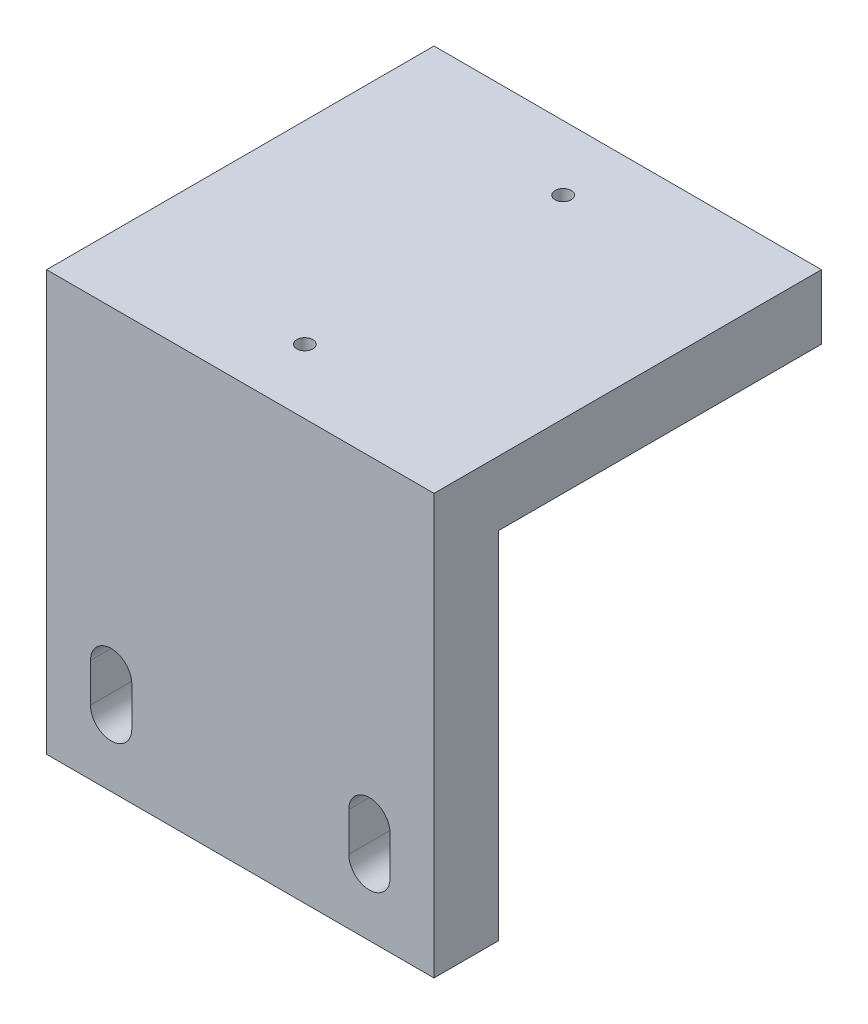
ISO-10303-21;
HEADER;
FILE_DESCRIPTION(('STEP AP214'),'2;1');
FILE_NAME('part.step','',(''),(''),'','','');
FILE_SCHEMA(('AUTOMOTIVE_DESIGN { 1 0 10303 214 1 1 1 1 }'));
ENDSEC;
DATA;
#1=APPLICATION_CONTEXT('core data for automotive mechanical design processes');
#2=APPLICATION_PROTOCOL_DEFINITION('international standard','automotive_design',2000,#1);
#3=PRODUCT_CONTEXT('',#1,'mechanical');
#4=PRODUCT('Part','Part','',(#3));
#5=PRODUCT_RELATED_PRODUCT_CATEGORY('part','',(#4));
#6=PRODUCT_DEFINITION_FORMATION('','',#4);
#7=PRODUCT_DEFINITION_CONTEXT('part definition',#1,'design');
#8=PRODUCT_DEFINITION('design','',#6,#7);
#9=PRODUCT_DEFINITION_SHAPE('','',#8);
#10=(LENGTH_UNIT() NAMED_UNIT(*) SI_UNIT(.MILLI.,.METRE.));
#11=(NAMED_UNIT(*) PLANE_ANGLE_UNIT() SI_UNIT($,.RADIAN.));
#12=(NAMED_UNIT(*) SI_UNIT($,.STERADIAN.) SOLID_ANGLE_UNIT());
#13=UNCERTAINTY_MEASURE_WITH_UNIT(LENGTH_MEASURE(1.E-05),#10,'distance_accuracy_value','');
#14=(GEOMETRIC_REPRESENTATION_CONTEXT(3) GLOBAL_UNCERTAINTY_ASSIGNED_CONTEXT((#13)) GLOBAL_UNIT_ASSIGNED_CONTEXT((#10,
#11,#12)) REPRESENTATION_CONTEXT('',''));
#15=CARTESIAN_POINT('',(0.,0.,0.));
#16=DIRECTION('',(0.,0.,1.));
#17=DIRECTION('',(1.,0.,0.));
#18=AXIS2_PLACEMENT_3D('',#15,#16,#17);
#19=CARTESIAN_POINT('',(-30.,-32.5,60.));
#20=DIRECTION('',(1.,0.,0.));
#21=DIRECTION('',(0.,0.,-1.));
#22=AXIS2_PLACEMENT_3D('',#19,#20,#21);
#23=PLANE('',#22);
#24=DIRECTION('',(0.,0.,-1.));
#25=VECTOR('',#24,1.);
#26=CARTESIAN_POINT('',(-30.,22.5,141.394102980499));
#27=LINE('',#26,#25);
#28=CARTESIAN_POINT('',(-30.,22.5,50.));
#29=VERTEX_POINT('',#28);
#30=CARTESIAN_POINT('',(-30.,22.5,0.));
#31=VERTEX_POINT('',#30);
#32=EDGE_CURVE('E210',#29,#31,#27,.T.);
#33=ORIENTED_EDGE('',*,*,#32,.F.);
#34=DIRECTION('',(0.,1.,0.));
#35=VECTOR('',#34,1.);
#36=CARTESIAN_POINT('',(-30.,-32.5,50.));
#37=LINE('',#36,#35);
#38=CARTESIAN_POINT('',(-30.,-32.5,50.));
#39=VERTEX_POINT('',#38);
#40=EDGE_CURVE('E202',#39,#29,#37,.T.);
#41=ORIENTED_EDGE('',*,*,#40,.F.);
#42=DIRECTION('',(0.,0.,-1.));
#43=VECTOR('',#42,1.);
#44=CARTESIAN_POINT('',(-30.,-32.5,60.));
#45=LINE('',#44,#43);
#46=CARTESIAN_POINT('',(-30.,-32.5,60.));
#47=VERTEX_POINT('',#46);
#48=EDGE_CURVE('E240',#47,#39,#45,.T.);
#49=ORIENTED_EDGE('',*,*,#48,.F.);
#50=DIRECTION('',(0.,-1.,0.));
#51=VECTOR('',#50,1.);
#52=CARTESIAN_POINT('',(-30.,-32.5,60.));
#53=LINE('',#52,#51);
#54=CARTESIAN_POINT('',(-30.,32.5,60.));
#55=VERTEX_POINT('',#54);
#56=EDGE_CURVE('E216',#55,#47,#53,.T.);
#57=ORIENTED_EDGE('',*,*,#56,.F.);
#58=DIRECTION('',(0.,0.,-1.));
#59=VECTOR('',#58,1.);
#60=CARTESIAN_POINT('',(-30.,32.5,60.));
#61=LINE('',#60,#59);
#62=CARTESIAN_POINT('',(-30.,32.5,0.));
#63=VERTEX_POINT('',#62);
#64=EDGE_CURVE('E226',#55,#63,#61,.T.);
#65=ORIENTED_EDGE('',*,*,#64,.T.);
#66=DIRECTION('',(0.,-1.,0.));
#67=VECTOR('',#66,1.);
#68=CARTESIAN_POINT('',(-30.,-32.5,0.));
#69=LINE('',#68,#67);
#70=EDGE_CURVE('E205',#63,#31,#69,.T.);
#71=ORIENTED_EDGE('',*,*,#70,.T.);
#72=EDGE_LOOP('',(#33,#41,#49,#57,#65,#71));
#73=FACE_BOUND('',#72,.T.);
#74=ADVANCED_FACE('F36',(#73),#23,.F.);
#75=CARTESIAN_POINT('',(30.,-32.5,60.));
#76=DIRECTION('',(0.,1.,0.));
#77=DIRECTION('',(-1.,0.,0.));
#78=AXIS2_PLACEMENT_3D('',#75,#76,#77);
#79=PLANE('',#78);
#80=ORIENTED_EDGE('',*,*,#48,.T.);
#81=DIRECTION('',(-1.,0.,0.));
#82=VECTOR('',#81,1.);
#83=CARTESIAN_POINT('',(30.,-32.5,50.));
#84=LINE('',#83,#82);
#85=CARTESIAN_POINT('',(30.,-32.5,50.));
#86=VERTEX_POINT('',#85);
#87=EDGE_CURVE('E200',#86,#39,#84,.T.);
#88=ORIENTED_EDGE('',*,*,#87,.F.);
#89=DIRECTION('',(0.,0.,-1.));
#90=VECTOR('',#89,1.);
#91=CARTESIAN_POINT('',(30.,-32.5,60.));
#92=LINE('',#91,#90);
#93=CARTESIAN_POINT('',(30.,-32.5,60.));
#94=VERTEX_POINT('',#93);
#95=EDGE_CURVE('E237',#94,#86,#92,.T.);
#96=ORIENTED_EDGE('',*,*,#95,.F.);
#97=DIRECTION('',(1.,0.,0.));
#98=VECTOR('',#97,1.);
#99=CARTESIAN_POINT('',(30.,-32.5,60.));
#100=LINE('',#99,#98);
#101=EDGE_CURVE('E219',#47,#94,#100,.T.);
#102=ORIENTED_EDGE('',*,*,#101,.F.);
#103=EDGE_LOOP('',(#80,#88,#96,#102));
#104=FACE_BOUND('',#103,.T.);
#105=ADVANCED_FACE('F292',(#104),#79,.F.);
#106=CARTESIAN_POINT('',(30.,-32.5,60.));
#107=DIRECTION('',(-1.,0.,0.));
#108=DIRECTION('',(0.,0.,1.));
#109=AXIS2_PLACEMENT_3D('',#106,#107,#108);
#110=PLANE('',#109);
#111=ORIENTED_EDGE('',*,*,#95,.T.);
#112=DIRECTION('',(0.,-1.,0.));
#113=VECTOR('',#112,1.);
#114=CARTESIAN_POINT('',(30.,-32.5,50.));
#115=LINE('',#114,#113);
#116=CARTESIAN_POINT('',(30.,22.5,50.));
#117=VERTEX_POINT('',#116);
#118=EDGE_CURVE('E203',#117,#86,#115,.T.);
#119=ORIENTED_EDGE('',*,*,#118,.F.);
#120=DIRECTION('',(0.,0.,-1.));
#121=VECTOR('',#120,1.);
#122=CARTESIAN_POINT('',(30.,22.5,141.394102980499));
#123=LINE('',#122,#121);
#124=CARTESIAN_POINT('',(30.,22.5,0.));
#125=VERTEX_POINT('',#124);
#126=EDGE_CURVE('E206',#117,#125,#123,.T.);
#127=ORIENTED_EDGE('',*,*,#126,.T.);
#128=DIRECTION('',(0.,1.,0.));
#129=VECTOR('',#128,1.);
#130=CARTESIAN_POINT('',(30.,-32.5,0.));
#131=LINE('',#130,#129);
#132=CARTESIAN_POINT('',(30.,32.5,0.));
#133=VERTEX_POINT('',#132);
#134=EDGE_CURVE('E229',#125,#133,#131,.T.);
#135=ORIENTED_EDGE('',*,*,#134,.T.);
#136=DIRECTION('',(0.,0.,-1.));
#137=VECTOR('',#136,1.);
#138=CARTESIAN_POINT('',(30.,32.5,60.));
#139=LINE('',#138,#137);
#140=CARTESIAN_POINT('',(30.,32.5,60.));
#141=VERTEX_POINT('',#140);
#142=EDGE_CURVE('E234',#141,#133,#139,.T.);
#143=ORIENTED_EDGE('',*,*,#142,.F.);
#144=DIRECTION('',(0.,1.,0.));
#145=VECTOR('',#144,1.);
#146=CARTESIAN_POINT('',(30.,-32.5,60.));
#147=LINE('',#146,#145);
#148=EDGE_CURVE('E222',#94,#141,#147,.T.);
#149=ORIENTED_EDGE('',*,*,#148,.F.);
#150=EDGE_LOOP('',(#111,#119,#127,#135,#143,#149));
#151=FACE_BOUND('',#150,.T.);
#152=ADVANCED_FACE('F297',(#151),#110,.F.);
#153=CARTESIAN_POINT('',(30.,32.5,60.));
#154=DIRECTION('',(0.,-1.,0.));
#155=DIRECTION('',(1.,0.,0.));
#156=AXIS2_PLACEMENT_3D('',#153,#154,#155);
#157=PLANE('',#156);
#158=CARTESIAN_POINT('',(0.,32.5,10.));
#159=DIRECTION('',(0.,1.,0.));
#160=DIRECTION('',(0.,0.,1.));
#161=AXIS2_PLACEMENT_3D('',#158,#159,#160);
#162=CIRCLE('',#161,1.25);
#163=CARTESIAN_POINT('',(0.,32.5,11.25));
#164=VERTEX_POINT('',#163);
#165=EDGE_CURVE('E152',#164,#164,#162,.T.);
#166=ORIENTED_EDGE('',*,*,#165,.F.);
#167=EDGE_LOOP('',(#166));
#168=FACE_BOUND('',#167,.T.);
#169=CARTESIAN_POINT('',(0.,32.5,50.));
#170=DIRECTION('',(0.,1.,0.));
#171=DIRECTION('',(0.,0.,1.));
#172=AXIS2_PLACEMENT_3D('',#169,#170,#171);
#173=CIRCLE('',#172,1.25);
#174=CARTESIAN_POINT('',(0.,32.5,51.25));
#175=VERTEX_POINT('',#174);
#176=EDGE_CURVE('E151',#175,#175,#173,.T.);
#177=ORIENTED_EDGE('',*,*,#176,.F.);
#178=EDGE_LOOP('',(#177));
#179=FACE_BOUND('',#178,.T.);
#180=DIRECTION('',(-1.,0.,0.));
#181=VECTOR('',#180,1.);
#182=CARTESIAN_POINT('',(30.,32.5,0.));
#183=LINE('',#182,#181);
#184=EDGE_CURVE('E220',#133,#63,#183,.T.);
#185=ORIENTED_EDGE('',*,*,#184,.T.);
#186=ORIENTED_EDGE('',*,*,#64,.F.);
#187=DIRECTION('',(-1.,0.,0.));
#188=VECTOR('',#187,1.);
#189=CARTESIAN_POINT('',(30.,32.5,60.));
#190=LINE('',#189,#188);
#191=EDGE_CURVE('E224',#141,#55,#190,.T.);
#192=ORIENTED_EDGE('',*,*,#191,.F.);
#193=ORIENTED_EDGE('',*,*,#142,.T.);
#194=EDGE_LOOP('',(#185,#186,#192,#193));
#195=FACE_BOUND('',#194,.T.);
#196=ADVANCED_FACE('F316',(#168,#179,#195),#157,.F.);
#197=CARTESIAN_POINT('',(0.,0.,60.));
#198=DIRECTION('',(0.,0.,1.));
#199=DIRECTION('',(1.,0.,0.));
#200=AXIS2_PLACEMENT_3D('',#197,#198,#199);
#201=PLANE('',#200);
#202=CARTESIAN_POINT('',(20.,-22.5,60.));
#203=DIRECTION('',(0.,0.,1.));
#204=DIRECTION('',(-1.,0.,0.));
#205=AXIS2_PLACEMENT_3D('',#202,#203,#204);
#206=CIRCLE('',#205,3.2);
#207=CARTESIAN_POINT('',(16.8,-22.5,60.));
#208=VERTEX_POINT('',#207);
#209=CARTESIAN_POINT('',(23.2,-22.5,60.));
#210=VERTEX_POINT('',#209);
#211=EDGE_CURVE('E50',#208,#210,#206,.T.);
#212=ORIENTED_EDGE('',*,*,#211,.F.);
#213=DIRECTION('',(0.,-1.,0.));
#214=VECTOR('',#213,1.);
#215=CARTESIAN_POINT('',(16.8,-22.5,60.));
#216=LINE('',#215,#214);
#217=CARTESIAN_POINT('',(16.8,-16.5,60.));
#218=VERTEX_POINT('',#217);
#219=EDGE_CURVE('E168',#218,#208,#216,.T.);
#220=ORIENTED_EDGE('',*,*,#219,.F.);
#221=CARTESIAN_POINT('',(20.,-16.5,60.));
#222=DIRECTION('',(0.,0.,1.));
#223=DIRECTION('',(-1.,0.,0.));
#224=AXIS2_PLACEMENT_3D('',#221,#222,#223);
#225=CIRCLE('',#224,3.2);
#226=CARTESIAN_POINT('',(23.2,-16.5,60.));
#227=VERTEX_POINT('',#226);
#228=EDGE_CURVE('E165',#227,#218,#225,.T.);
#229=ORIENTED_EDGE('',*,*,#228,.F.);
#230=DIRECTION('',(0.,1.,0.));
#231=VECTOR('',#230,1.);
#232=CARTESIAN_POINT('',(23.2,-22.5,60.));
#233=LINE('',#232,#231);
#234=EDGE_CURVE('E163',#210,#227,#233,.T.);
#235=ORIENTED_EDGE('',*,*,#234,.F.);
#236=EDGE_LOOP('',(#212,#220,#229,#235));
#237=FACE_BOUND('',#236,.T.);
#238=CARTESIAN_POINT('',(-20.,-22.5,60.));
#239=DIRECTION('',(0.,0.,1.));
#240=DIRECTION('',(1.,0.,0.));
#241=AXIS2_PLACEMENT_3D('',#238,#239,#240);
#242=CIRCLE('',#241,3.20000000000001);
#243=CARTESIAN_POINT('',(-23.2,-22.5,60.));
#244=VERTEX_POINT('',#243);
#245=CARTESIAN_POINT('',(-16.8,-22.5,60.));
#246=VERTEX_POINT('',#245);
#247=EDGE_CURVE('E174',#244,#246,#242,.T.);
#248=ORIENTED_EDGE('',*,*,#247,.F.);
#249=DIRECTION('',(0.,-1.,0.));
#250=VECTOR('',#249,1.);
#251=CARTESIAN_POINT('',(-23.2,-22.5,60.));
#252=LINE('',#251,#250);
#253=CARTESIAN_POINT('',(-23.2,-16.5,60.));
#254=VERTEX_POINT('',#253);
#255=EDGE_CURVE('E186',#254,#244,#252,.T.);
#256=ORIENTED_EDGE('',*,*,#255,.F.);
#257=CARTESIAN_POINT('',(-20.,-16.5,60.));
#258=DIRECTION('',(0.,0.,1.));
#259=DIRECTION('',(1.,0.,0.));
#260=AXIS2_PLACEMENT_3D('',#257,#258,#259);
#261=CIRCLE('',#260,3.2);
#262=CARTESIAN_POINT('',(-16.8,-16.5,60.));
#263=VERTEX_POINT('',#262);
#264=EDGE_CURVE('E183',#263,#254,#261,.T.);
#265=ORIENTED_EDGE('',*,*,#264,.F.);
#266=DIRECTION('',(0.,1.,0.));
#267=VECTOR('',#266,1.);
#268=CARTESIAN_POINT('',(-16.8,-22.5,60.));
#269=LINE('',#268,#267);
#270=EDGE_CURVE('E180',#246,#263,#269,.T.);
#271=ORIENTED_EDGE('',*,*,#270,.F.);
#272=EDGE_LOOP('',(#248,#256,#265,#271));
#273=FACE_BOUND('',#272,.T.);
#274=ORIENTED_EDGE('',*,*,#56,.T.);
#275=ORIENTED_EDGE('',*,*,#101,.T.);
#276=ORIENTED_EDGE('',*,*,#148,.T.);
#277=ORIENTED_EDGE('',*,*,#191,.T.);
#278=EDGE_LOOP('',(#274,#275,#276,#277));
#279=FACE_BOUND('',#278,.T.);
#280=ADVANCED_FACE('F274',(#237,#273,#279),#201,.T.);
#281=CARTESIAN_POINT('',(0.,0.,0.));
#282=DIRECTION('',(0.,0.,1.));
#283=DIRECTION('',(1.,0.,0.));
#284=AXIS2_PLACEMENT_3D('',#281,#282,#283);
#285=PLANE('',#284);
#286=ORIENTED_EDGE('',*,*,#134,.F.);
#287=DIRECTION('',(1.,0.,0.));
#288=VECTOR('',#287,1.);
#289=CARTESIAN_POINT('',(30.,22.5,0.));
#290=LINE('',#289,#288);
#291=EDGE_CURVE('E192',#31,#125,#290,.T.);
#292=ORIENTED_EDGE('',*,*,#291,.F.);
#293=ORIENTED_EDGE('',*,*,#70,.F.);
#294=ORIENTED_EDGE('',*,*,#184,.F.);
#295=EDGE_LOOP('',(#286,#292,#293,#294));
#296=FACE_BOUND('',#295,.T.);
#297=ADVANCED_FACE('F308',(#296),#285,.F.);
#298=CARTESIAN_POINT('',(0.,0.,50.));
#299=DIRECTION('',(0.,0.,1.));
#300=DIRECTION('',(1.,0.,0.));
#301=AXIS2_PLACEMENT_3D('',#298,#299,#300);
#302=PLANE('',#301);
#303=DIRECTION('',(0.,-1.,0.));
#304=VECTOR('',#303,1.);
#305=CARTESIAN_POINT('',(16.8,0.,50.));
#306=LINE('',#305,#304);
#307=CARTESIAN_POINT('',(16.8,-16.5,50.));
#308=VERTEX_POINT('',#307);
#309=CARTESIAN_POINT('',(16.8,-22.5,50.));
#310=VERTEX_POINT('',#309);
#311=EDGE_CURVE('E43',#308,#310,#306,.T.);
#312=ORIENTED_EDGE('',*,*,#311,.T.);
#313=CARTESIAN_POINT('',(20.,-22.5,50.));
#314=DIRECTION('',(0.,0.,1.));
#315=DIRECTION('',(1.,0.,0.));
#316=AXIS2_PLACEMENT_3D('',#313,#314,#315);
#317=CIRCLE('',#316,3.2);
#318=CARTESIAN_POINT('',(23.2,-22.5,50.));
#319=VERTEX_POINT('',#318);
#320=EDGE_CURVE('E12',#310,#319,#317,.T.);
#321=ORIENTED_EDGE('',*,*,#320,.T.);
#322=DIRECTION('',(0.,1.,0.));
#323=VECTOR('',#322,1.);
#324=CARTESIAN_POINT('',(23.2,0.,50.));
#325=LINE('',#324,#323);
#326=CARTESIAN_POINT('',(23.2,-16.5,50.));
#327=VERTEX_POINT('',#326);
#328=EDGE_CURVE('E255',#319,#327,#325,.T.);
#329=ORIENTED_EDGE('',*,*,#328,.T.);
#330=CARTESIAN_POINT('',(20.,-16.5,50.));
#331=DIRECTION('',(0.,0.,1.));
#332=DIRECTION('',(1.,0.,0.));
#333=AXIS2_PLACEMENT_3D('',#330,#331,#332);
#334=CIRCLE('',#333,3.2);
#335=EDGE_CURVE('E258',#327,#308,#334,.T.);
#336=ORIENTED_EDGE('',*,*,#335,.T.);
#337=EDGE_LOOP('',(#312,#321,#329,#336));
#338=FACE_BOUND('',#337,.T.);
#339=DIRECTION('',(0.,-1.,0.));
#340=VECTOR('',#339,1.);
#341=CARTESIAN_POINT('',(-23.2,0.,50.));
#342=LINE('',#341,#340);
#343=CARTESIAN_POINT('',(-23.2,-16.5,50.));
#344=VERTEX_POINT('',#343);
#345=CARTESIAN_POINT('',(-23.2,-22.5,50.));
#346=VERTEX_POINT('',#345);
#347=EDGE_CURVE('E249',#344,#346,#342,.T.);
#348=ORIENTED_EDGE('',*,*,#347,.T.);
#349=CARTESIAN_POINT('',(-20.,-22.5,50.));
#350=DIRECTION('',(0.,0.,1.));
#351=DIRECTION('',(1.,0.,0.));
#352=AXIS2_PLACEMENT_3D('',#349,#350,#351);
#353=CIRCLE('',#352,3.20000000000001);
#354=CARTESIAN_POINT('',(-16.8,-22.5,50.));
#355=VERTEX_POINT('',#354);
#356=EDGE_CURVE('E252',#346,#355,#353,.T.);
#357=ORIENTED_EDGE('',*,*,#356,.T.);
#358=DIRECTION('',(0.,1.,0.));
#359=VECTOR('',#358,1.);
#360=CARTESIAN_POINT('',(-16.8,0.,50.));
#361=LINE('',#360,#359);
#362=CARTESIAN_POINT('',(-16.8,-16.5,50.));
#363=VERTEX_POINT('',#362);
#364=EDGE_CURVE('E243',#355,#363,#361,.T.);
#365=ORIENTED_EDGE('',*,*,#364,.T.);
#366=CARTESIAN_POINT('',(-20.,-16.5,50.));
#367=DIRECTION('',(0.,0.,1.));
#368=DIRECTION('',(1.,0.,0.));
#369=AXIS2_PLACEMENT_3D('',#366,#367,#368);
#370=CIRCLE('',#369,3.2);
#371=EDGE_CURVE('E246',#363,#344,#370,.T.);
#372=ORIENTED_EDGE('',*,*,#371,.T.);
#373=EDGE_LOOP('',(#348,#357,#365,#372));
#374=FACE_BOUND('',#373,.T.);
#375=ORIENTED_EDGE('',*,*,#118,.T.);
#376=ORIENTED_EDGE('',*,*,#87,.T.);
#377=ORIENTED_EDGE('',*,*,#40,.T.);
#378=DIRECTION('',(1.,0.,0.));
#379=VECTOR('',#378,1.);
#380=CARTESIAN_POINT('',(30.,22.5,50.));
#381=LINE('',#380,#379);
#382=EDGE_CURVE('E207',#29,#117,#381,.T.);
#383=ORIENTED_EDGE('',*,*,#382,.T.);
#384=EDGE_LOOP('',(#375,#376,#377,#383));
#385=FACE_BOUND('',#384,.T.);
#386=ADVANCED_FACE('F262',(#338,#374,#385),#302,.F.);
#387=CARTESIAN_POINT('',(30.,22.5,141.394102980499));
#388=DIRECTION('',(0.,1.,0.));
#389=DIRECTION('',(0.,0.,1.));
#390=AXIS2_PLACEMENT_3D('',#387,#388,#389);
#391=PLANE('',#390);
#392=ORIENTED_EDGE('',*,*,#32,.T.);
#393=ORIENTED_EDGE('',*,*,#291,.T.);
#394=ORIENTED_EDGE('',*,*,#126,.F.);
#395=ORIENTED_EDGE('',*,*,#382,.F.);
#396=EDGE_LOOP('',(#392,#393,#394,#395));
#397=FACE_BOUND('',#396,.T.);
#398=ADVANCED_FACE('F305',(#397),#391,.F.);
#399=CARTESIAN_POINT('',(-20.,-22.5,0.));
#400=DIRECTION('',(0.,0.,1.));
#401=DIRECTION('',(1.,0.,0.));
#402=AXIS2_PLACEMENT_3D('',#399,#400,#401);
#403=CYLINDRICAL_SURFACE('',#402,3.20000000000001);
#404=DIRECTION('',(0.,0.,1.));
#405=VECTOR('',#404,1.);
#406=CARTESIAN_POINT('',(-23.2,-22.5,0.));
#407=LINE('',#406,#405);
#408=EDGE_CURVE('E190',#346,#244,#407,.T.);
#409=ORIENTED_EDGE('',*,*,#408,.T.);
#410=ORIENTED_EDGE('',*,*,#247,.T.);
#411=DIRECTION('',(0.,0.,1.));
#412=VECTOR('',#411,1.);
#413=CARTESIAN_POINT('',(-16.8,-22.5,0.));
#414=LINE('',#413,#412);
#415=EDGE_CURVE('E189',#355,#246,#414,.T.);
#416=ORIENTED_EDGE('',*,*,#415,.F.);
#417=ORIENTED_EDGE('',*,*,#356,.F.);
#418=EDGE_LOOP('',(#409,#410,#416,#417));
#419=FACE_BOUND('',#418,.T.);
#420=ADVANCED_FACE('F329',(#419),#403,.F.);
#421=CARTESIAN_POINT('',(-23.2,-22.5,0.));
#422=DIRECTION('',(-1.,0.,0.));
#423=DIRECTION('',(0.,-1.,0.));
#424=AXIS2_PLACEMENT_3D('',#421,#422,#423);
#425=PLANE('',#424);
#426=DIRECTION('',(0.,0.,1.));
#427=VECTOR('',#426,1.);
#428=CARTESIAN_POINT('',(-23.2,-16.5,0.));
#429=LINE('',#428,#427);
#430=EDGE_CURVE('E193',#344,#254,#429,.T.);
#431=ORIENTED_EDGE('',*,*,#430,.T.);
#432=ORIENTED_EDGE('',*,*,#255,.T.);
#433=ORIENTED_EDGE('',*,*,#408,.F.);
#434=ORIENTED_EDGE('',*,*,#347,.F.);
#435=EDGE_LOOP('',(#431,#432,#433,#434));
#436=FACE_BOUND('',#435,.T.);
#437=ADVANCED_FACE('F374',(#436),#425,.F.);
#438=CARTESIAN_POINT('',(-20.,-16.5,0.));
#439=DIRECTION('',(0.,0.,1.));
#440=DIRECTION('',(1.,0.,0.));
#441=AXIS2_PLACEMENT_3D('',#438,#439,#440);
#442=CYLINDRICAL_SURFACE('',#441,3.2);
#443=DIRECTION('',(0.,0.,1.));
#444=VECTOR('',#443,1.);
#445=CARTESIAN_POINT('',(-16.8,-16.5,0.));
#446=LINE('',#445,#444);
#447=EDGE_CURVE('E195',#363,#263,#446,.T.);
#448=ORIENTED_EDGE('',*,*,#447,.T.);
#449=ORIENTED_EDGE('',*,*,#264,.T.);
#450=ORIENTED_EDGE('',*,*,#430,.F.);
#451=ORIENTED_EDGE('',*,*,#371,.F.);
#452=EDGE_LOOP('',(#448,#449,#450,#451));
#453=FACE_BOUND('',#452,.T.);
#454=ADVANCED_FACE('F286',(#453),#442,.F.);
#455=CARTESIAN_POINT('',(-16.8,-22.5,0.));
#456=DIRECTION('',(1.,0.,0.));
#457=DIRECTION('',(0.,0.,-1.));
#458=AXIS2_PLACEMENT_3D('',#455,#456,#457);
#459=PLANE('',#458);
#460=ORIENTED_EDGE('',*,*,#415,.T.);
#461=ORIENTED_EDGE('',*,*,#270,.T.);
#462=ORIENTED_EDGE('',*,*,#447,.F.);
#463=ORIENTED_EDGE('',*,*,#364,.F.);
#464=EDGE_LOOP('',(#460,#461,#462,#463));
#465=FACE_BOUND('',#464,.T.);
#466=ADVANCED_FACE('F279',(#465),#459,.F.);
#467=CARTESIAN_POINT('',(20.,-22.5,0.));
#468=DIRECTION('',(0.,0.,1.));
#469=DIRECTION('',(1.,0.,0.));
#470=AXIS2_PLACEMENT_3D('',#467,#468,#469);
#471=CYLINDRICAL_SURFACE('',#470,3.2);
#472=DIRECTION('',(0.,0.,1.));
#473=VECTOR('',#472,1.);
#474=CARTESIAN_POINT('',(16.8,-22.5,0.));
#475=LINE('',#474,#473);
#476=EDGE_CURVE('E172',#310,#208,#475,.T.);
#477=ORIENTED_EDGE('',*,*,#476,.T.);
#478=ORIENTED_EDGE('',*,*,#211,.T.);
#479=DIRECTION('',(0.,0.,1.));
#480=VECTOR('',#479,1.);
#481=CARTESIAN_POINT('',(23.2,-22.5,0.));
#482=LINE('',#481,#480);
#483=EDGE_CURVE('E171',#319,#210,#482,.T.);
#484=ORIENTED_EDGE('',*,*,#483,.F.);
#485=ORIENTED_EDGE('',*,*,#320,.F.);
#486=EDGE_LOOP('',(#477,#478,#484,#485));
#487=FACE_BOUND('',#486,.T.);
#488=ADVANCED_FACE('F277',(#487),#471,.F.);
#489=CARTESIAN_POINT('',(16.8,-22.5,0.));
#490=DIRECTION('',(-1.,0.,0.));
#491=DIRECTION('',(0.,0.,1.));
#492=AXIS2_PLACEMENT_3D('',#489,#490,#491);
#493=PLANE('',#492);
#494=DIRECTION('',(0.,0.,1.));
#495=VECTOR('',#494,1.);
#496=CARTESIAN_POINT('',(16.8,-16.5,0.));
#497=LINE('',#496,#495);
#498=EDGE_CURVE('E175',#308,#218,#497,.T.);
#499=ORIENTED_EDGE('',*,*,#498,.T.);
#500=ORIENTED_EDGE('',*,*,#219,.T.);
#501=ORIENTED_EDGE('',*,*,#476,.F.);
#502=ORIENTED_EDGE('',*,*,#311,.F.);
#503=EDGE_LOOP('',(#499,#500,#501,#502));
#504=FACE_BOUND('',#503,.T.);
#505=ADVANCED_FACE('F267',(#504),#493,.F.);
#506=CARTESIAN_POINT('',(20.,-16.5,0.));
#507=DIRECTION('',(0.,0.,1.));
#508=DIRECTION('',(1.,0.,0.));
#509=AXIS2_PLACEMENT_3D('',#506,#507,#508);
#510=CYLINDRICAL_SURFACE('',#509,3.2);
#511=DIRECTION('',(0.,0.,1.));
#512=VECTOR('',#511,1.);
#513=CARTESIAN_POINT('',(23.2,-16.5,0.));
#514=LINE('',#513,#512);
#515=EDGE_CURVE('E58',#327,#227,#514,.T.);
#516=ORIENTED_EDGE('',*,*,#515,.T.);
#517=ORIENTED_EDGE('',*,*,#228,.T.);
#518=ORIENTED_EDGE('',*,*,#498,.F.);
#519=ORIENTED_EDGE('',*,*,#335,.F.);
#520=EDGE_LOOP('',(#516,#517,#518,#519));
#521=FACE_BOUND('',#520,.T.);
#522=ADVANCED_FACE('F269',(#521),#510,.F.);
#523=CARTESIAN_POINT('',(23.2,-22.5,0.));
#524=DIRECTION('',(1.,0.,0.));
#525=DIRECTION('',(0.,0.,-1.));
#526=AXIS2_PLACEMENT_3D('',#523,#524,#525);
#527=PLANE('',#526);
#528=ORIENTED_EDGE('',*,*,#483,.T.);
#529=ORIENTED_EDGE('',*,*,#234,.T.);
#530=ORIENTED_EDGE('',*,*,#515,.F.);
#531=ORIENTED_EDGE('',*,*,#328,.F.);
#532=EDGE_LOOP('',(#528,#529,#530,#531));
#533=FACE_BOUND('',#532,.T.);
#534=ADVANCED_FACE('F276',(#533),#527,.F.);
#535=CARTESIAN_POINT('',(0.,25.,50.));
#536=DIRECTION('',(0.,1.,0.));
#537=DIRECTION('',(0.,0.,1.));
#538=AXIS2_PLACEMENT_3D('',#535,#536,#537);
#539=CONICAL_SURFACE('',#538,1.25,1.02974425867665);
#540=CARTESIAN_POINT('',(0.,24.2489242262155,50.));
#541=VERTEX_POINT('',#540);
#542=VERTEX_LOOP('',#541);
#543=FACE_BOUND('',#542,.T.);
#544=CARTESIAN_POINT('',(0.,25.,50.));
#545=DIRECTION('',(0.,1.,0.));
#546=DIRECTION('',(0.,0.,1.));
#547=AXIS2_PLACEMENT_3D('',#544,#545,#546);
#548=CIRCLE('',#547,1.25);
#549=CARTESIAN_POINT('',(0.,25.,51.25));
#550=VERTEX_POINT('',#549);
#551=EDGE_CURVE('E155',#550,#550,#548,.T.);
#552=ORIENTED_EDGE('',*,*,#551,.T.);
#553=EDGE_LOOP('',(#552));
#554=FACE_BOUND('',#553,.T.);
#555=ADVANCED_FACE('F416',(#543,#554),#539,.F.);
#556=CARTESIAN_POINT('',(0.,32.5,50.));
#557=DIRECTION('',(0.,1.,0.));
#558=DIRECTION('',(0.,0.,1.));
#559=AXIS2_PLACEMENT_3D('',#556,#557,#558);
#560=CYLINDRICAL_SURFACE('',#559,1.25);
#561=ORIENTED_EDGE('',*,*,#551,.F.);
#562=EDGE_LOOP('',(#561));
#563=FACE_BOUND('',#562,.T.);
#564=ORIENTED_EDGE('',*,*,#176,.T.);
#565=EDGE_LOOP('',(#564));
#566=FACE_BOUND('',#565,.T.);
#567=ADVANCED_FACE('F145',(#563,#566),#560,.F.);
#568=CARTESIAN_POINT('',(0.,25.,10.));
#569=DIRECTION('',(0.,1.,0.));
#570=DIRECTION('',(0.,0.,1.));
#571=AXIS2_PLACEMENT_3D('',#568,#569,#570);
#572=CONICAL_SURFACE('',#571,1.25,1.02974425867665);
#573=CARTESIAN_POINT('',(0.,24.2489242262155,10.));
#574=VERTEX_POINT('',#573);
#575=VERTEX_LOOP('',#574);
#576=FACE_BOUND('',#575,.T.);
#577=CARTESIAN_POINT('',(0.,25.,10.));
#578=DIRECTION('',(0.,1.,0.));
#579=DIRECTION('',(0.,0.,1.));
#580=AXIS2_PLACEMENT_3D('',#577,#578,#579);
#581=CIRCLE('',#580,1.25);
#582=CARTESIAN_POINT('',(0.,25.,11.25));
#583=VERTEX_POINT('',#582);
#584=EDGE_CURVE('E149',#583,#583,#581,.T.);
#585=ORIENTED_EDGE('',*,*,#584,.T.);
#586=EDGE_LOOP('',(#585));
#587=FACE_BOUND('',#586,.T.);
#588=ADVANCED_FACE('F141',(#576,#587),#572,.F.);
#589=CARTESIAN_POINT('',(0.,32.5,10.));
#590=DIRECTION('',(0.,1.,0.));
#591=DIRECTION('',(0.,0.,1.));
#592=AXIS2_PLACEMENT_3D('',#589,#590,#591);
#593=CYLINDRICAL_SURFACE('',#592,1.25);
#594=ORIENTED_EDGE('',*,*,#584,.F.);
#595=EDGE_LOOP('',(#594));
#596=FACE_BOUND('',#595,.T.);
#597=ORIENTED_EDGE('',*,*,#165,.T.);
#598=EDGE_LOOP('',(#597));
#599=FACE_BOUND('',#598,.T.);
#600=ADVANCED_FACE('F144',(#596,#599),#593,.F.);
#601=CLOSED_SHELL('',(#74,#105,#152,#196,#280,#297,#386,#398,#420,#437,#454,#466,#488,#505,#522,
#534,#555,#567,#588,#600));
#602=MANIFOLD_SOLID_BREP('B2',#601);
#603=ADVANCED_BREP_SHAPE_REPRESENTATION('',(#18,#602),#14);
#604=SHAPE_DEFINITION_REPRESENTATION(#9,#603);
ENDSEC;
END-ISO-10303-21;
